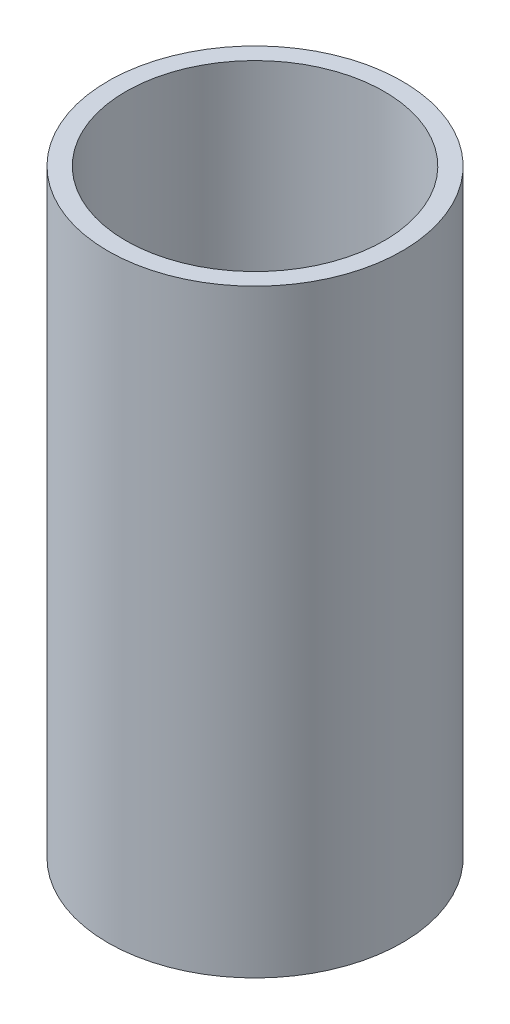
ISO-10303-21;
HEADER;
FILE_DESCRIPTION(('STEP AP214'),'2;1');
FILE_NAME('part.step','',(''),(''),'','','');
FILE_SCHEMA(('AUTOMOTIVE_DESIGN { 1 0 10303 214 1 1 1 1 }'));
ENDSEC;
DATA;
#1=APPLICATION_CONTEXT('core data for automotive mechanical design processes');
#2=APPLICATION_PROTOCOL_DEFINITION('international standard','automotive_design',2000,#1);
#3=PRODUCT_CONTEXT('',#1,'mechanical');
#4=PRODUCT('Part','Part','',(#3));
#5=PRODUCT_RELATED_PRODUCT_CATEGORY('part','',(#4));
#6=PRODUCT_DEFINITION_FORMATION('','',#4);
#7=PRODUCT_DEFINITION_CONTEXT('part definition',#1,'design');
#8=PRODUCT_DEFINITION('design','',#6,#7);
#9=PRODUCT_DEFINITION_SHAPE('','',#8);
#10=(LENGTH_UNIT() NAMED_UNIT(*) SI_UNIT(.MILLI.,.METRE.));
#11=(NAMED_UNIT(*) PLANE_ANGLE_UNIT() SI_UNIT($,.RADIAN.));
#12=(NAMED_UNIT(*) SI_UNIT($,.STERADIAN.) SOLID_ANGLE_UNIT());
#13=UNCERTAINTY_MEASURE_WITH_UNIT(LENGTH_MEASURE(1.E-05),#10,'distance_accuracy_value','');
#14=(GEOMETRIC_REPRESENTATION_CONTEXT(3) GLOBAL_UNCERTAINTY_ASSIGNED_CONTEXT((#13)) GLOBAL_UNIT_ASSIGNED_CONTEXT((#10,
#11,#12)) REPRESENTATION_CONTEXT('',''));
#15=CARTESIAN_POINT('',(0.,0.,0.));
#16=DIRECTION('',(0.,0.,1.));
#17=DIRECTION('',(1.,0.,0.));
#18=AXIS2_PLACEMENT_3D('',#15,#16,#17);
#19=CARTESIAN_POINT('',(0.,235.5,0.));
#20=DIRECTION('',(0.,1.,0.));
#21=DIRECTION('',(0.,0.,1.));
#22=AXIS2_PLACEMENT_3D('',#19,#20,#21);
#23=PLANE('',#22);
#24=CARTESIAN_POINT('',(0.,235.5,0.));
#25=DIRECTION('',(0.,1.,0.));
#26=DIRECTION('',(0.,0.,1.));
#27=AXIS2_PLACEMENT_3D('',#24,#25,#26);
#28=CIRCLE('',#27,57.8369865259026);
#29=CARTESIAN_POINT('',(0.,235.5,57.8369865259026));
#30=VERTEX_POINT('',#29);
#31=EDGE_CURVE('E10',#30,#30,#28,.T.);
#32=ORIENTED_EDGE('',*,*,#31,.T.);
#33=EDGE_LOOP('',(#32));
#34=FACE_BOUND('',#33,.T.);
#35=CARTESIAN_POINT('',(0.,235.5,0.));
#36=DIRECTION('',(0.,1.,0.));
#37=DIRECTION('',(0.,0.,1.));
#38=AXIS2_PLACEMENT_3D('',#35,#36,#37);
#39=CIRCLE('',#38,50.8);
#40=CARTESIAN_POINT('',(0.,235.5,50.8));
#41=VERTEX_POINT('',#40);
#42=EDGE_CURVE('E46',#41,#41,#39,.T.);
#43=ORIENTED_EDGE('',*,*,#42,.F.);
#44=EDGE_LOOP('',(#43));
#45=FACE_BOUND('',#44,.T.);
#46=ADVANCED_FACE('F35',(#34,#45),#23,.T.);
#47=CARTESIAN_POINT('',(0.,0.,0.));
#48=DIRECTION('',(0.,1.,0.));
#49=DIRECTION('',(0.,0.,1.));
#50=AXIS2_PLACEMENT_3D('',#47,#48,#49);
#51=PLANE('',#50);
#52=CARTESIAN_POINT('',(0.,0.,0.));
#53=DIRECTION('',(0.,1.,0.));
#54=DIRECTION('',(0.,0.,1.));
#55=AXIS2_PLACEMENT_3D('',#52,#53,#54);
#56=CIRCLE('',#55,57.8369865259026);
#57=CARTESIAN_POINT('',(0.,0.,57.8369865259026));
#58=VERTEX_POINT('',#57);
#59=EDGE_CURVE('E39',#58,#58,#56,.T.);
#60=ORIENTED_EDGE('',*,*,#59,.F.);
#61=EDGE_LOOP('',(#60));
#62=FACE_BOUND('',#61,.T.);
#63=CARTESIAN_POINT('',(0.,0.,0.));
#64=DIRECTION('',(0.,1.,0.));
#65=DIRECTION('',(0.,0.,1.));
#66=AXIS2_PLACEMENT_3D('',#63,#64,#65);
#67=CIRCLE('',#66,50.8);
#68=CARTESIAN_POINT('',(0.,0.,50.8));
#69=VERTEX_POINT('',#68);
#70=EDGE_CURVE('E48',#69,#69,#67,.T.);
#71=ORIENTED_EDGE('',*,*,#70,.T.);
#72=EDGE_LOOP('',(#71));
#73=FACE_BOUND('',#72,.T.);
#74=ADVANCED_FACE('F58',(#62,#73),#51,.F.);
#75=CARTESIAN_POINT('',(0.,235.5,0.));
#76=DIRECTION('',(0.,-1.,0.));
#77=DIRECTION('',(0.,0.,-1.));
#78=AXIS2_PLACEMENT_3D('',#75,#76,#77);
#79=CYLINDRICAL_SURFACE('',#78,57.8369865259026);
#80=ORIENTED_EDGE('',*,*,#31,.F.);
#81=EDGE_LOOP('',(#80));
#82=FACE_BOUND('',#81,.T.);
#83=ORIENTED_EDGE('',*,*,#59,.T.);
#84=EDGE_LOOP('',(#83));
#85=FACE_BOUND('',#84,.T.);
#86=ADVANCED_FACE('F37',(#82,#85),#79,.T.);
#87=CARTESIAN_POINT('',(0.,235.5,0.));
#88=DIRECTION('',(0.,-1.,0.));
#89=DIRECTION('',(0.,0.,-1.));
#90=AXIS2_PLACEMENT_3D('',#87,#88,#89);
#91=CYLINDRICAL_SURFACE('',#90,50.8);
#92=ORIENTED_EDGE('',*,*,#42,.T.);
#93=EDGE_LOOP('',(#92));
#94=FACE_BOUND('',#93,.T.);
#95=ORIENTED_EDGE('',*,*,#70,.F.);
#96=EDGE_LOOP('',(#95));
#97=FACE_BOUND('',#96,.T.);
#98=ADVANCED_FACE('F54',(#94,#97),#91,.F.);
#99=CLOSED_SHELL('',(#46,#74,#86,#98));
#100=MANIFOLD_SOLID_BREP('B2',#99);
#101=ADVANCED_BREP_SHAPE_REPRESENTATION('',(#18,#100),#14);
#102=SHAPE_DEFINITION_REPRESENTATION(#9,#101);
ENDSEC;
END-ISO-10303-21;
